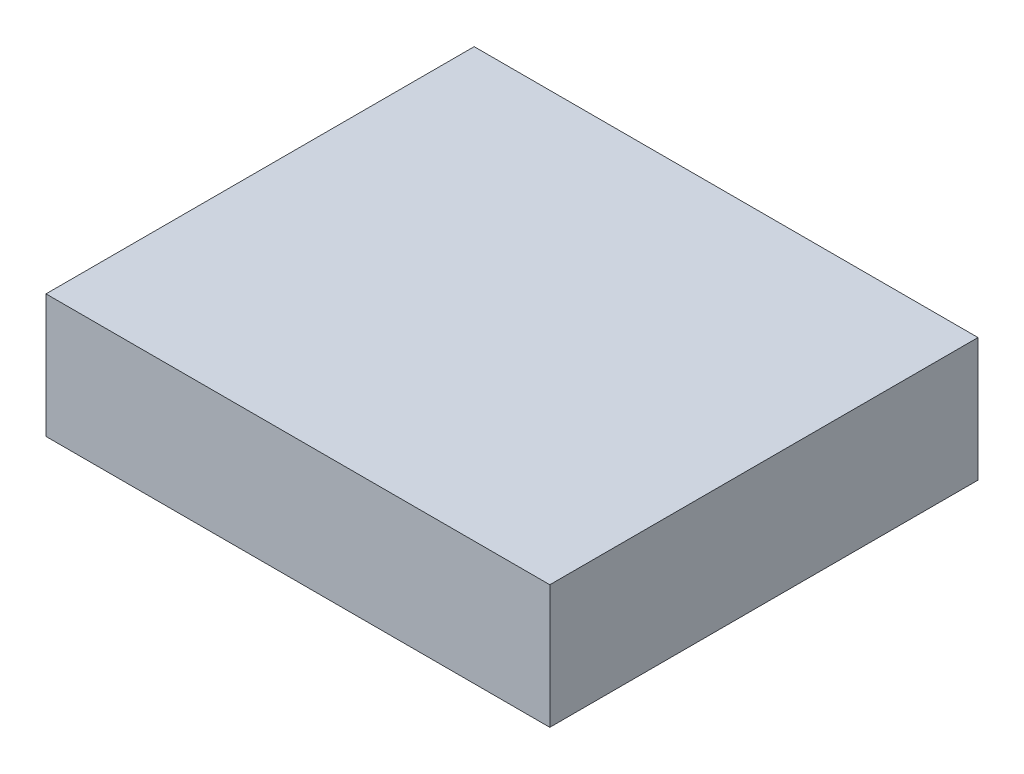
ISO-10303-21;
HEADER;
FILE_DESCRIPTION(('STEP AP214'),'2;1');
FILE_NAME('part.step','',(''),(''),'','','');
FILE_SCHEMA(('AUTOMOTIVE_DESIGN { 1 0 10303 214 1 1 1 1 }'));
ENDSEC;
DATA;
#1=APPLICATION_CONTEXT('core data for automotive mechanical design processes');
#2=APPLICATION_PROTOCOL_DEFINITION('international standard','automotive_design',2000,#1);
#3=PRODUCT_CONTEXT('',#1,'mechanical');
#4=PRODUCT('Part','Part','',(#3));
#5=PRODUCT_RELATED_PRODUCT_CATEGORY('part','',(#4));
#6=PRODUCT_DEFINITION_FORMATION('','',#4);
#7=PRODUCT_DEFINITION_CONTEXT('part definition',#1,'design');
#8=PRODUCT_DEFINITION('design','',#6,#7);
#9=PRODUCT_DEFINITION_SHAPE('','',#8);
#10=(LENGTH_UNIT() NAMED_UNIT(*) SI_UNIT(.MILLI.,.METRE.));
#11=(NAMED_UNIT(*) PLANE_ANGLE_UNIT() SI_UNIT($,.RADIAN.));
#12=(NAMED_UNIT(*) SI_UNIT($,.STERADIAN.) SOLID_ANGLE_UNIT());
#13=UNCERTAINTY_MEASURE_WITH_UNIT(LENGTH_MEASURE(1.E-05),#10,'distance_accuracy_value','');
#14=(GEOMETRIC_REPRESENTATION_CONTEXT(3) GLOBAL_UNCERTAINTY_ASSIGNED_CONTEXT((#13)) GLOBAL_UNIT_ASSIGNED_CONTEXT((#10,
#11,#12)) REPRESENTATION_CONTEXT('',''));
#15=CARTESIAN_POINT('',(0.,0.,0.));
#16=DIRECTION('',(0.,0.,1.));
#17=DIRECTION('',(1.,0.,0.));
#18=AXIS2_PLACEMENT_3D('',#15,#16,#17);
#19=CARTESIAN_POINT('',(41.6965507337117,18.75,33.75));
#20=DIRECTION('',(-1.,0.,0.));
#21=DIRECTION('',(0.,0.,1.));
#22=AXIS2_PLACEMENT_3D('',#19,#20,#21);
#23=PLANE('',#22);
#24=DIRECTION('',(0.,0.,-1.));
#25=VECTOR('',#24,1.);
#26=CARTESIAN_POINT('',(41.6965507337117,0.,33.75));
#27=LINE('',#26,#25);
#28=CARTESIAN_POINT('',(41.6965507337117,0.,33.75));
#29=VERTEX_POINT('',#28);
#30=CARTESIAN_POINT('',(41.6965507337118,0.,-31.25));
#31=VERTEX_POINT('',#30);
#32=EDGE_CURVE('E104',#29,#31,#27,.T.);
#33=ORIENTED_EDGE('',*,*,#32,.T.);
#34=DIRECTION('',(0.,-1.,0.));
#35=VECTOR('',#34,1.);
#36=CARTESIAN_POINT('',(41.6965507337118,18.75,-31.25));
#37=LINE('',#36,#35);
#38=CARTESIAN_POINT('',(41.6965507337118,18.75,-31.25));
#39=VERTEX_POINT('',#38);
#40=EDGE_CURVE('E11',#39,#31,#37,.T.);
#41=ORIENTED_EDGE('',*,*,#40,.F.);
#42=DIRECTION('',(0.,0.,-1.));
#43=VECTOR('',#42,1.);
#44=CARTESIAN_POINT('',(41.6965507337117,18.75,33.75));
#45=LINE('',#44,#43);
#46=CARTESIAN_POINT('',(41.6965507337117,18.75,33.75));
#47=VERTEX_POINT('',#46);
#48=EDGE_CURVE('E92',#47,#39,#45,.T.);
#49=ORIENTED_EDGE('',*,*,#48,.F.);
#50=DIRECTION('',(0.,-1.,0.));
#51=VECTOR('',#50,1.);
#52=CARTESIAN_POINT('',(41.6965507337117,18.75,33.75));
#53=LINE('',#52,#51);
#54=EDGE_CURVE('E100',#47,#29,#53,.T.);
#55=ORIENTED_EDGE('',*,*,#54,.T.);
#56=EDGE_LOOP('',(#33,#41,#49,#55));
#57=FACE_BOUND('',#56,.T.);
#58=ADVANCED_FACE('F41',(#57),#23,.F.);
#59=CARTESIAN_POINT('',(-34.7845991572247,18.75,-31.25));
#60=DIRECTION('',(0.,0.,1.));
#61=DIRECTION('',(1.,0.,0.));
#62=AXIS2_PLACEMENT_3D('',#59,#60,#61);
#63=PLANE('',#62);
#64=DIRECTION('',(-1.,0.,0.));
#65=VECTOR('',#64,1.);
#66=CARTESIAN_POINT('',(-34.7845991572247,0.,-31.25));
#67=LINE('',#66,#65);
#68=CARTESIAN_POINT('',(-34.7845991572247,0.,-31.25));
#69=VERTEX_POINT('',#68);
#70=EDGE_CURVE('E96',#31,#69,#67,.T.);
#71=ORIENTED_EDGE('',*,*,#70,.T.);
#72=DIRECTION('',(0.,-1.,0.));
#73=VECTOR('',#72,1.);
#74=CARTESIAN_POINT('',(-34.7845991572247,18.75,-31.25));
#75=LINE('',#74,#73);
#76=CARTESIAN_POINT('',(-34.7845991572247,18.75,-31.25));
#77=VERTEX_POINT('',#76);
#78=EDGE_CURVE('E49',#77,#69,#75,.T.);
#79=ORIENTED_EDGE('',*,*,#78,.F.);
#80=DIRECTION('',(-1.,0.,0.));
#81=VECTOR('',#80,1.);
#82=CARTESIAN_POINT('',(-34.7845991572247,18.75,-31.25));
#83=LINE('',#82,#81);
#84=EDGE_CURVE('E87',#39,#77,#83,.T.);
#85=ORIENTED_EDGE('',*,*,#84,.F.);
#86=ORIENTED_EDGE('',*,*,#40,.T.);
#87=EDGE_LOOP('',(#71,#79,#85,#86));
#88=FACE_BOUND('',#87,.T.);
#89=ADVANCED_FACE('F95',(#88),#63,.F.);
#90=CARTESIAN_POINT('',(-34.7845991572246,18.75,33.75));
#91=DIRECTION('',(1.,0.,0.));
#92=DIRECTION('',(0.,0.,-1.));
#93=AXIS2_PLACEMENT_3D('',#90,#91,#92);
#94=PLANE('',#93);
#95=DIRECTION('',(0.,0.,1.));
#96=VECTOR('',#95,1.);
#97=CARTESIAN_POINT('',(-34.7845991572246,0.,33.75));
#98=LINE('',#97,#96);
#99=CARTESIAN_POINT('',(-34.7845991572246,0.,33.75));
#100=VERTEX_POINT('',#99);
#101=EDGE_CURVE('E74',#69,#100,#98,.T.);
#102=ORIENTED_EDGE('',*,*,#101,.T.);
#103=DIRECTION('',(0.,-1.,0.));
#104=VECTOR('',#103,1.);
#105=CARTESIAN_POINT('',(-34.7845991572246,18.75,33.75));
#106=LINE('',#105,#104);
#107=CARTESIAN_POINT('',(-34.7845991572246,18.75,33.75));
#108=VERTEX_POINT('',#107);
#109=EDGE_CURVE('E97',#108,#100,#106,.T.);
#110=ORIENTED_EDGE('',*,*,#109,.F.);
#111=DIRECTION('',(0.,0.,1.));
#112=VECTOR('',#111,1.);
#113=CARTESIAN_POINT('',(-34.7845991572246,18.75,33.75));
#114=LINE('',#113,#112);
#115=EDGE_CURVE('E90',#77,#108,#114,.T.);
#116=ORIENTED_EDGE('',*,*,#115,.F.);
#117=ORIENTED_EDGE('',*,*,#78,.T.);
#118=EDGE_LOOP('',(#102,#110,#116,#117));
#119=FACE_BOUND('',#118,.T.);
#120=ADVANCED_FACE('F98',(#119),#94,.F.);
#121=CARTESIAN_POINT('',(-34.7845991572246,18.75,33.75));
#122=DIRECTION('',(0.,0.,-1.));
#123=DIRECTION('',(-1.,0.,0.));
#124=AXIS2_PLACEMENT_3D('',#121,#122,#123);
#125=PLANE('',#124);
#126=DIRECTION('',(1.,0.,0.));
#127=VECTOR('',#126,1.);
#128=CARTESIAN_POINT('',(-34.7845991572246,0.,33.75));
#129=LINE('',#128,#127);
#130=EDGE_CURVE('E80',#100,#29,#129,.T.);
#131=ORIENTED_EDGE('',*,*,#130,.T.);
#132=ORIENTED_EDGE('',*,*,#54,.F.);
#133=DIRECTION('',(1.,0.,0.));
#134=VECTOR('',#133,1.);
#135=CARTESIAN_POINT('',(-34.7845991572246,18.75,33.75));
#136=LINE('',#135,#134);
#137=EDGE_CURVE('E57',#108,#47,#136,.T.);
#138=ORIENTED_EDGE('',*,*,#137,.F.);
#139=ORIENTED_EDGE('',*,*,#109,.T.);
#140=EDGE_LOOP('',(#131,#132,#138,#139));
#141=FACE_BOUND('',#140,.T.);
#142=ADVANCED_FACE('F111',(#141),#125,.F.);
#143=CARTESIAN_POINT('',(0.,18.75,0.));
#144=DIRECTION('',(0.,-1.,0.));
#145=DIRECTION('',(0.,0.,-1.));
#146=AXIS2_PLACEMENT_3D('',#143,#144,#145);
#147=PLANE('',#146);
#148=ORIENTED_EDGE('',*,*,#48,.T.);
#149=ORIENTED_EDGE('',*,*,#84,.T.);
#150=ORIENTED_EDGE('',*,*,#115,.T.);
#151=ORIENTED_EDGE('',*,*,#137,.T.);
#152=EDGE_LOOP('',(#148,#149,#150,#151));
#153=FACE_BOUND('',#152,.T.);
#154=ADVANCED_FACE('F88',(#153),#147,.F.);
#155=CARTESIAN_POINT('',(0.,0.,0.));
#156=DIRECTION('',(0.,-1.,0.));
#157=DIRECTION('',(0.,0.,-1.));
#158=AXIS2_PLACEMENT_3D('',#155,#156,#157);
#159=PLANE('',#158);
#160=ORIENTED_EDGE('',*,*,#32,.F.);
#161=ORIENTED_EDGE('',*,*,#130,.F.);
#162=ORIENTED_EDGE('',*,*,#101,.F.);
#163=ORIENTED_EDGE('',*,*,#70,.F.);
#164=EDGE_LOOP('',(#160,#161,#162,#163));
#165=FACE_BOUND('',#164,.T.);
#166=ADVANCED_FACE('F114',(#165),#159,.T.);
#167=CLOSED_SHELL('',(#58,#89,#120,#142,#154,#166));
#168=MANIFOLD_SOLID_BREP('B2',#167);
#169=ADVANCED_BREP_SHAPE_REPRESENTATION('',(#18,#168),#14);
#170=SHAPE_DEFINITION_REPRESENTATION(#9,#169);
ENDSEC;
END-ISO-10303-21;
